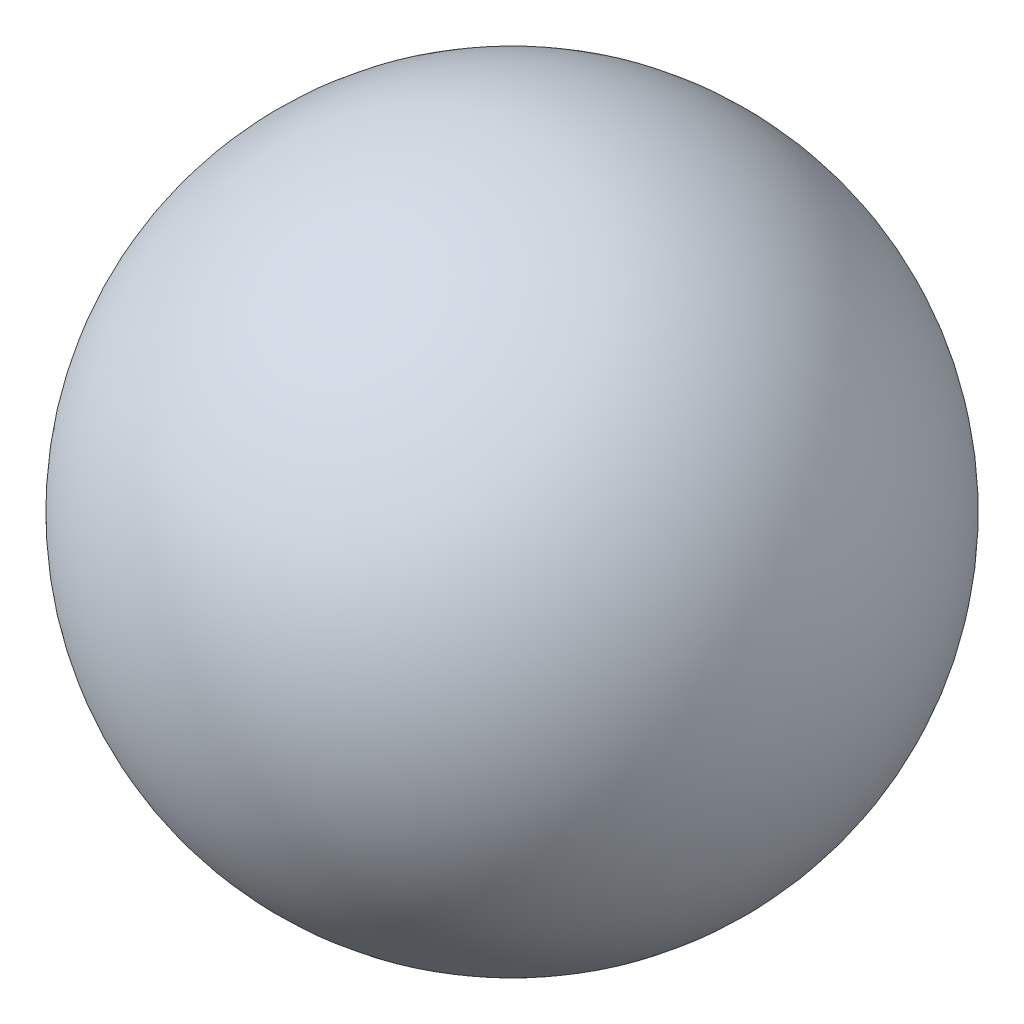
ISO-10303-21;
HEADER;
FILE_DESCRIPTION(('STEP AP214'),'2;1');
FILE_NAME('part.step','',(''),(''),'','','');
FILE_SCHEMA(('AUTOMOTIVE_DESIGN { 1 0 10303 214 1 1 1 1 }'));
ENDSEC;
DATA;
#1=APPLICATION_CONTEXT('core data for automotive mechanical design processes');
#2=APPLICATION_PROTOCOL_DEFINITION('international standard','automotive_design',2000,#1);
#3=PRODUCT_CONTEXT('',#1,'mechanical');
#4=PRODUCT('Part','Part','',(#3));
#5=PRODUCT_RELATED_PRODUCT_CATEGORY('part','',(#4));
#6=PRODUCT_DEFINITION_FORMATION('','',#4);
#7=PRODUCT_DEFINITION_CONTEXT('part definition',#1,'design');
#8=PRODUCT_DEFINITION('design','',#6,#7);
#9=PRODUCT_DEFINITION_SHAPE('','',#8);
#10=(LENGTH_UNIT() NAMED_UNIT(*) SI_UNIT(.MILLI.,.METRE.));
#11=(NAMED_UNIT(*) PLANE_ANGLE_UNIT() SI_UNIT($,.RADIAN.));
#12=(NAMED_UNIT(*) SI_UNIT($,.STERADIAN.) SOLID_ANGLE_UNIT());
#13=UNCERTAINTY_MEASURE_WITH_UNIT(LENGTH_MEASURE(1.E-05),#10,'distance_accuracy_value','');
#14=(GEOMETRIC_REPRESENTATION_CONTEXT(3) GLOBAL_UNCERTAINTY_ASSIGNED_CONTEXT((#13)) GLOBAL_UNIT_ASSIGNED_CONTEXT((#10,
#11,#12)) REPRESENTATION_CONTEXT('',''));
#15=CARTESIAN_POINT('',(0.,0.,0.));
#16=DIRECTION('',(0.,0.,1.));
#17=DIRECTION('',(1.,0.,0.));
#18=AXIS2_PLACEMENT_3D('',#15,#16,#17);
#19=CARTESIAN_POINT('',(0.,0.,0.));
#20=DIRECTION('',(0.,1.,0.));
#21=DIRECTION('',(1.,0.,0.));
#22=AXIS2_PLACEMENT_3D('',#19,#20,#21);
#23=SPHERICAL_SURFACE('',#22,32.5);
#24=CARTESIAN_POINT('',(0.,32.5,0.));
#25=VERTEX_POINT('',#24);
#26=VERTEX_LOOP('',#25);
#27=FACE_BOUND('',#26,.T.);
#28=ADVANCED_FACE('F27',(#27),#23,.T.);
#29=CLOSED_SHELL('',(#28));
#30=MANIFOLD_SOLID_BREP('B2',#29);
#31=ADVANCED_BREP_SHAPE_REPRESENTATION('',(#18,#30),#14);
#32=SHAPE_DEFINITION_REPRESENTATION(#9,#31);
ENDSEC;
END-ISO-10303-21;
